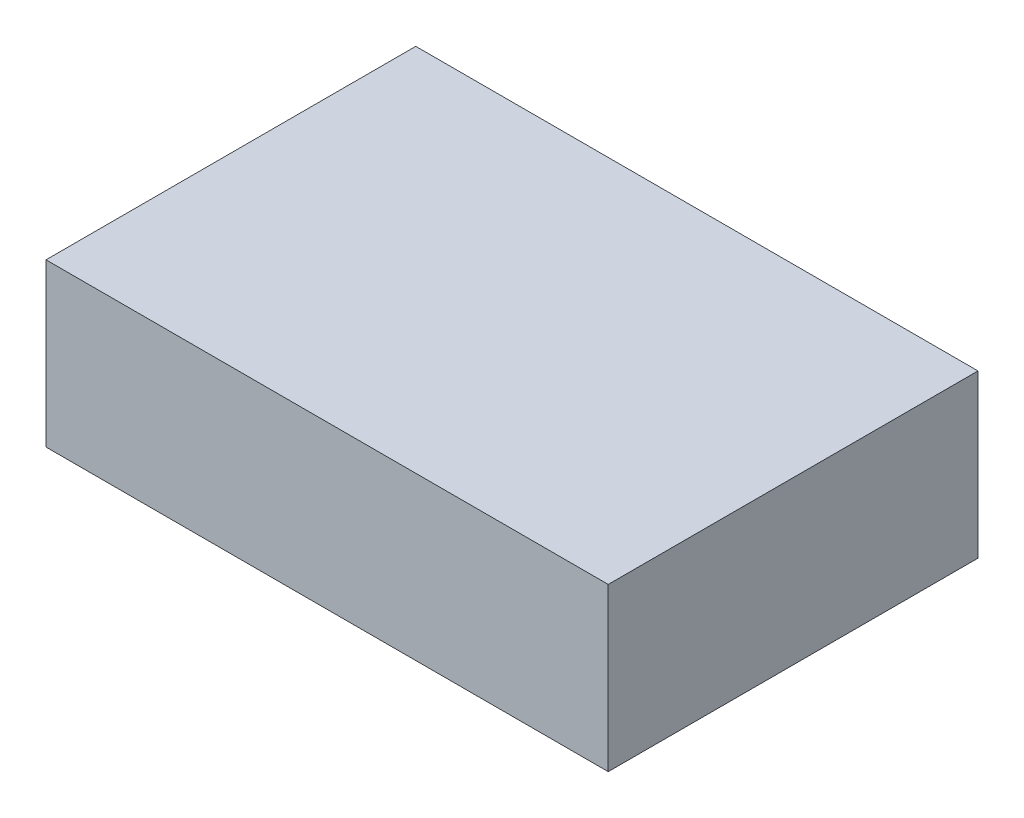
ISO-10303-21;
HEADER;
FILE_DESCRIPTION(('STEP AP214'),'2;1');
FILE_NAME('part.step','',(''),(''),'','','');
FILE_SCHEMA(('AUTOMOTIVE_DESIGN { 1 0 10303 214 1 1 1 1 }'));
ENDSEC;
DATA;
#1=APPLICATION_CONTEXT('core data for automotive mechanical design processes');
#2=APPLICATION_PROTOCOL_DEFINITION('international standard','automotive_design',2000,#1);
#3=PRODUCT_CONTEXT('',#1,'mechanical');
#4=PRODUCT('Part','Part','',(#3));
#5=PRODUCT_RELATED_PRODUCT_CATEGORY('part','',(#4));
#6=PRODUCT_DEFINITION_FORMATION('','',#4);
#7=PRODUCT_DEFINITION_CONTEXT('part definition',#1,'design');
#8=PRODUCT_DEFINITION('design','',#6,#7);
#9=PRODUCT_DEFINITION_SHAPE('','',#8);
#10=(LENGTH_UNIT() NAMED_UNIT(*) SI_UNIT(.MILLI.,.METRE.));
#11=(NAMED_UNIT(*) PLANE_ANGLE_UNIT() SI_UNIT($,.RADIAN.));
#12=(NAMED_UNIT(*) SI_UNIT($,.STERADIAN.) SOLID_ANGLE_UNIT());
#13=UNCERTAINTY_MEASURE_WITH_UNIT(LENGTH_MEASURE(1.E-05),#10,'distance_accuracy_value','');
#14=(GEOMETRIC_REPRESENTATION_CONTEXT(3) GLOBAL_UNCERTAINTY_ASSIGNED_CONTEXT((#13)) GLOBAL_UNIT_ASSIGNED_CONTEXT((#10,
#11,#12)) REPRESENTATION_CONTEXT('',''));
#15=CARTESIAN_POINT('',(0.,0.,0.));
#16=DIRECTION('',(0.,0.,1.));
#17=DIRECTION('',(1.,0.,0.));
#18=AXIS2_PLACEMENT_3D('',#15,#16,#17);
#19=CARTESIAN_POINT('',(-0.65000124,0.18750026,0.));
#20=DIRECTION('',(0.,1.,0.));
#21=DIRECTION('',(0.,0.,1.));
#22=AXIS2_PLACEMENT_3D('',#19,#20,#21);
#23=PLANE('',#22);
#24=DIRECTION('',(0.,0.,-1.));
#25=VECTOR('',#24,1.);
#26=CARTESIAN_POINT('',(0.65000124,0.18750026,0.));
#27=LINE('',#26,#25);
#28=CARTESIAN_POINT('',(0.65000124,0.18750026,0.));
#29=VERTEX_POINT('',#28);
#30=CARTESIAN_POINT('',(0.65000124,0.18750026,0.855));
#31=VERTEX_POINT('',#30);
#32=EDGE_CURVE('E20',#29,#31,#27,.F.);
#33=ORIENTED_EDGE('',*,*,#32,.F.);
#34=DIRECTION('',(1.,0.,0.));
#35=VECTOR('',#34,1.);
#36=CARTESIAN_POINT('',(0.65000124,0.18750026,0.));
#37=LINE('',#36,#35);
#38=CARTESIAN_POINT('',(-0.65000124,0.18750026,0.));
#39=VERTEX_POINT('',#38);
#40=EDGE_CURVE('E80',#29,#39,#37,.F.);
#41=ORIENTED_EDGE('',*,*,#40,.T.);
#42=DIRECTION('',(0.,0.,1.));
#43=VECTOR('',#42,1.);
#44=CARTESIAN_POINT('',(-0.65000124,0.18750026,0.));
#45=LINE('',#44,#43);
#46=CARTESIAN_POINT('',(-0.65000124,0.18750026,0.855));
#47=VERTEX_POINT('',#46);
#48=EDGE_CURVE('E68',#47,#39,#45,.F.);
#49=ORIENTED_EDGE('',*,*,#48,.F.);
#50=DIRECTION('',(1.,0.,0.));
#51=VECTOR('',#50,1.);
#52=CARTESIAN_POINT('',(0.65000124,0.18750026,0.855));
#53=LINE('',#52,#51);
#54=EDGE_CURVE('E56',#31,#47,#53,.F.);
#55=ORIENTED_EDGE('',*,*,#54,.F.);
#56=EDGE_LOOP('',(#33,#41,#49,#55));
#57=FACE_BOUND('',#56,.T.);
#58=ADVANCED_FACE('F17',(#57),#23,.T.);
#59=CARTESIAN_POINT('',(0.65000124,0.18750026,0.));
#60=DIRECTION('',(1.,0.,0.));
#61=DIRECTION('',(0.,0.,-1.));
#62=AXIS2_PLACEMENT_3D('',#59,#60,#61);
#63=PLANE('',#62);
#64=DIRECTION('',(0.,0.,-1.));
#65=VECTOR('',#64,1.);
#66=CARTESIAN_POINT('',(0.65000124,-0.18750026,0.));
#67=LINE('',#66,#65);
#68=CARTESIAN_POINT('',(0.65000124,-0.18750026,0.));
#69=VERTEX_POINT('',#68);
#70=CARTESIAN_POINT('',(0.65000124,-0.18750026,0.855));
#71=VERTEX_POINT('',#70);
#72=EDGE_CURVE('E83',#69,#71,#67,.F.);
#73=ORIENTED_EDGE('',*,*,#72,.F.);
#74=DIRECTION('',(0.,1.,0.));
#75=VECTOR('',#74,1.);
#76=CARTESIAN_POINT('',(0.65000124,-0.18750026,0.));
#77=LINE('',#76,#75);
#78=EDGE_CURVE('E65',#69,#29,#77,.T.);
#79=ORIENTED_EDGE('',*,*,#78,.T.);
#80=ORIENTED_EDGE('',*,*,#32,.T.);
#81=DIRECTION('',(0.,1.,0.));
#82=VECTOR('',#81,1.);
#83=CARTESIAN_POINT('',(0.65000124,-0.18750026,0.855));
#84=LINE('',#83,#82);
#85=EDGE_CURVE('E62',#71,#31,#84,.T.);
#86=ORIENTED_EDGE('',*,*,#85,.F.);
#87=EDGE_LOOP('',(#73,#79,#80,#86));
#88=FACE_BOUND('',#87,.T.);
#89=ADVANCED_FACE('F61',(#88),#63,.T.);
#90=CARTESIAN_POINT('',(0.65000124,-0.18750026,0.855));
#91=DIRECTION('',(0.,0.,1.));
#92=DIRECTION('',(1.,0.,0.));
#93=AXIS2_PLACEMENT_3D('',#90,#91,#92);
#94=PLANE('',#93);
#95=DIRECTION('',(0.,1.,0.));
#96=VECTOR('',#95,1.);
#97=CARTESIAN_POINT('',(-0.65000124,-0.18750026,0.855));
#98=LINE('',#97,#96);
#99=CARTESIAN_POINT('',(-0.65000124,-0.18750026,0.855));
#100=VERTEX_POINT('',#99);
#101=EDGE_CURVE('E70',#100,#47,#98,.T.);
#102=ORIENTED_EDGE('',*,*,#101,.F.);
#103=DIRECTION('',(1.,0.,0.));
#104=VECTOR('',#103,1.);
#105=CARTESIAN_POINT('',(0.65000124,-0.18750026,0.855));
#106=LINE('',#105,#104);
#107=EDGE_CURVE('E74',#71,#100,#106,.F.);
#108=ORIENTED_EDGE('',*,*,#107,.F.);
#109=ORIENTED_EDGE('',*,*,#85,.T.);
#110=ORIENTED_EDGE('',*,*,#54,.T.);
#111=EDGE_LOOP('',(#102,#108,#109,#110));
#112=FACE_BOUND('',#111,.T.);
#113=ADVANCED_FACE('F72',(#112),#94,.T.);
#114=CARTESIAN_POINT('',(-0.65000124,-0.18750026,0.));
#115=DIRECTION('',(-1.,0.,0.));
#116=DIRECTION('',(0.,0.,1.));
#117=AXIS2_PLACEMENT_3D('',#114,#115,#116);
#118=PLANE('',#117);
#119=ORIENTED_EDGE('',*,*,#48,.T.);
#120=DIRECTION('',(0.,1.,0.));
#121=VECTOR('',#120,1.);
#122=CARTESIAN_POINT('',(-0.65000124,-0.18750026,0.));
#123=LINE('',#122,#121);
#124=CARTESIAN_POINT('',(-0.65000124,-0.18750026,0.));
#125=VERTEX_POINT('',#124);
#126=EDGE_CURVE('E35',#39,#125,#123,.F.);
#127=ORIENTED_EDGE('',*,*,#126,.T.);
#128=DIRECTION('',(0.,0.,-1.));
#129=VECTOR('',#128,1.);
#130=CARTESIAN_POINT('',(-0.65000124,-0.18750026,0.));
#131=LINE('',#130,#129);
#132=EDGE_CURVE('E26',#100,#125,#131,.T.);
#133=ORIENTED_EDGE('',*,*,#132,.F.);
#134=ORIENTED_EDGE('',*,*,#101,.T.);
#135=EDGE_LOOP('',(#119,#127,#133,#134));
#136=FACE_BOUND('',#135,.T.);
#137=ADVANCED_FACE('F89',(#136),#118,.T.);
#138=CARTESIAN_POINT('',(0.65000124,-0.18750026,0.));
#139=DIRECTION('',(0.,0.,1.));
#140=DIRECTION('',(1.,0.,0.));
#141=AXIS2_PLACEMENT_3D('',#138,#139,#140);
#142=PLANE('',#141);
#143=ORIENTED_EDGE('',*,*,#126,.F.);
#144=ORIENTED_EDGE('',*,*,#40,.F.);
#145=ORIENTED_EDGE('',*,*,#78,.F.);
#146=DIRECTION('',(1.,0.,0.));
#147=VECTOR('',#146,1.);
#148=CARTESIAN_POINT('',(0.65000124,-0.18750026,0.));
#149=LINE('',#148,#147);
#150=EDGE_CURVE('E11',#125,#69,#149,.T.);
#151=ORIENTED_EDGE('',*,*,#150,.F.);
#152=EDGE_LOOP('',(#143,#144,#145,#151));
#153=FACE_BOUND('',#152,.T.);
#154=ADVANCED_FACE('F91',(#153),#142,.F.);
#155=CARTESIAN_POINT('',(0.65000124,-0.18750026,0.));
#156=DIRECTION('',(0.,-1.,0.));
#157=DIRECTION('',(0.,0.,-1.));
#158=AXIS2_PLACEMENT_3D('',#155,#156,#157);
#159=PLANE('',#158);
#160=ORIENTED_EDGE('',*,*,#132,.T.);
#161=ORIENTED_EDGE('',*,*,#150,.T.);
#162=ORIENTED_EDGE('',*,*,#72,.T.);
#163=ORIENTED_EDGE('',*,*,#107,.T.);
#164=EDGE_LOOP('',(#160,#161,#162,#163));
#165=FACE_BOUND('',#164,.T.);
#166=ADVANCED_FACE('F88',(#165),#159,.T.);
#167=CLOSED_SHELL('',(#58,#89,#113,#137,#154,#166));
#168=MANIFOLD_SOLID_BREP('B1',#167);
#169=ADVANCED_BREP_SHAPE_REPRESENTATION('',(#18,#168),#14);
#170=SHAPE_DEFINITION_REPRESENTATION(#9,#169);
ENDSEC;
END-ISO-10303-21;
